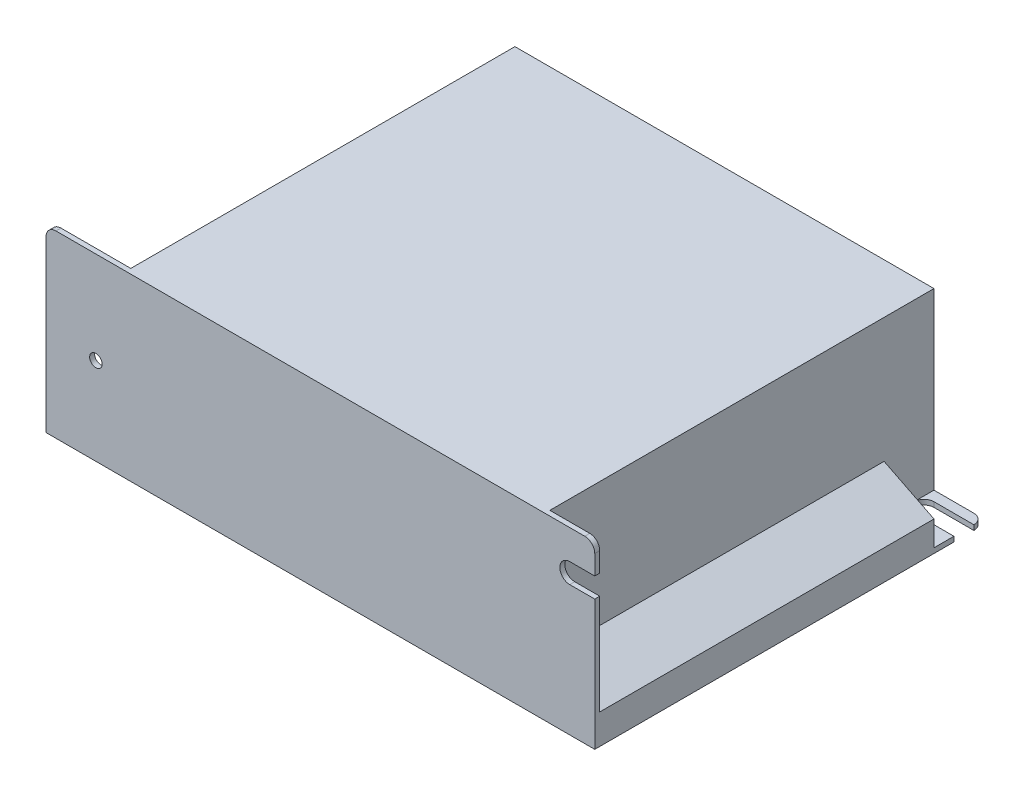
ISO-10303-21;
HEADER;
FILE_DESCRIPTION(('STEP AP214'),'2;1');
FILE_NAME('part.step','',(''),(''),'','','');
FILE_SCHEMA(('AUTOMOTIVE_DESIGN { 1 0 10303 214 1 1 1 1 }'));
ENDSEC;
DATA;
#1=APPLICATION_CONTEXT('core data for automotive mechanical design processes');
#2=APPLICATION_PROTOCOL_DEFINITION('international standard','automotive_design',2000,#1);
#3=PRODUCT_CONTEXT('',#1,'mechanical');
#4=PRODUCT('Part','Part','',(#3));
#5=PRODUCT_RELATED_PRODUCT_CATEGORY('part','',(#4));
#6=PRODUCT_DEFINITION_FORMATION('','',#4);
#7=PRODUCT_DEFINITION_CONTEXT('part definition',#1,'design');
#8=PRODUCT_DEFINITION('design','',#6,#7);
#9=PRODUCT_DEFINITION_SHAPE('','',#8);
#10=(LENGTH_UNIT() NAMED_UNIT(*) SI_UNIT(.MILLI.,.METRE.));
#11=(NAMED_UNIT(*) PLANE_ANGLE_UNIT() SI_UNIT($,.RADIAN.));
#12=(NAMED_UNIT(*) SI_UNIT($,.STERADIAN.) SOLID_ANGLE_UNIT());
#13=UNCERTAINTY_MEASURE_WITH_UNIT(LENGTH_MEASURE(1.E-05),#10,'distance_accuracy_value','');
#14=(GEOMETRIC_REPRESENTATION_CONTEXT(3) GLOBAL_UNCERTAINTY_ASSIGNED_CONTEXT((#13)) GLOBAL_UNIT_ASSIGNED_CONTEXT((#10,
#11,#12)) REPRESENTATION_CONTEXT('',''));
#15=CARTESIAN_POINT('',(0.,0.,0.));
#16=DIRECTION('',(0.,0.,1.));
#17=DIRECTION('',(1.,0.,0.));
#18=AXIS2_PLACEMENT_3D('',#15,#16,#17);
#19=CARTESIAN_POINT('',(0.,0.999999999999994,0.));
#20=DIRECTION('',(0.,-1.,0.));
#21=DIRECTION('',(0.,0.,-1.));
#22=AXIS2_PLACEMENT_3D('',#19,#20,#21);
#23=PLANE('',#22);
#24=DIRECTION('',(0.,0.,-1.));
#25=VECTOR('',#24,1.);
#26=CARTESIAN_POINT('',(110.,0.999999999999994,-78.));
#27=LINE('',#26,#25);
#28=CARTESIAN_POINT('',(110.,0.999999999999994,-68.));
#29=VERTEX_POINT('',#28);
#30=CARTESIAN_POINT('',(110.,0.999999999999994,-72.));
#31=VERTEX_POINT('',#30);
#32=EDGE_CURVE('E271',#29,#31,#27,.T.);
#33=ORIENTED_EDGE('',*,*,#32,.T.);
#34=DIRECTION('',(-1.,0.,0.));
#35=VECTOR('',#34,1.);
#36=CARTESIAN_POINT('',(0.,0.999999999999994,-72.));
#37=LINE('',#36,#35);
#38=CARTESIAN_POINT('',(102.,0.999999999999994,-72.));
#39=VERTEX_POINT('',#38);
#40=EDGE_CURVE('E11',#31,#39,#37,.T.);
#41=ORIENTED_EDGE('',*,*,#40,.T.);
#42=CARTESIAN_POINT('',(102.,0.999999999999994,-74.));
#43=DIRECTION('',(0.,-1.,0.));
#44=DIRECTION('',(0.,0.,-1.));
#45=AXIS2_PLACEMENT_3D('',#42,#43,#44);
#46=CIRCLE('',#45,2.);
#47=CARTESIAN_POINT('',(100.,0.999999999999994,-74.));
#48=VERTEX_POINT('',#47);
#49=EDGE_CURVE('E42',#39,#48,#46,.T.);
#50=ORIENTED_EDGE('',*,*,#49,.T.);
#51=DIRECTION('',(0.,0.,1.));
#52=VECTOR('',#51,1.);
#53=CARTESIAN_POINT('',(100.,0.999999999999994,-78.));
#54=LINE('',#53,#52);
#55=CARTESIAN_POINT('',(100.,0.999999999999994,-68.));
#56=VERTEX_POINT('',#55);
#57=EDGE_CURVE('E276',#48,#56,#54,.T.);
#58=ORIENTED_EDGE('',*,*,#57,.T.);
#59=DIRECTION('',(1.,0.,0.));
#60=VECTOR('',#59,1.);
#61=CARTESIAN_POINT('',(110.,0.999999999999994,-68.));
#62=LINE('',#61,#60);
#63=EDGE_CURVE('E280',#56,#29,#62,.T.);
#64=ORIENTED_EDGE('',*,*,#63,.T.);
#65=EDGE_LOOP('',(#33,#41,#50,#58,#64));
#66=FACE_BOUND('',#65,.T.);
#67=ADVANCED_FACE('F34',(#66),#23,.F.);
#68=CARTESIAN_POINT('',(110.,36.,0.));
#69=DIRECTION('',(-1.,0.,0.));
#70=DIRECTION('',(0.,0.,1.));
#71=AXIS2_PLACEMENT_3D('',#68,#69,#70);
#72=PLANE('',#71);
#73=DIRECTION('',(0.,1.,0.));
#74=VECTOR('',#73,1.);
#75=CARTESIAN_POINT('',(110.,11.,-1.));
#76=LINE('',#75,#74);
#77=CARTESIAN_POINT('',(110.,30.0968957296743,-1.));
#78=VERTEX_POINT('',#77);
#79=CARTESIAN_POINT('',(110.,34.,-1.));
#80=VERTEX_POINT('',#79);
#81=EDGE_CURVE('E303',#78,#80,#76,.T.);
#82=ORIENTED_EDGE('',*,*,#81,.T.);
#83=DIRECTION('',(0.,0.,-1.));
#84=VECTOR('',#83,1.);
#85=CARTESIAN_POINT('',(110.,34.,0.));
#86=LINE('',#85,#84);
#87=CARTESIAN_POINT('',(110.,34.,0.));
#88=VERTEX_POINT('',#87);
#89=EDGE_CURVE('E49',#80,#88,#86,.F.);
#90=ORIENTED_EDGE('',*,*,#89,.T.);
#91=DIRECTION('',(0.,-1.,0.));
#92=VECTOR('',#91,1.);
#93=CARTESIAN_POINT('',(110.,36.,0.));
#94=LINE('',#93,#92);
#95=CARTESIAN_POINT('',(110.,30.0968957296743,0.));
#96=VERTEX_POINT('',#95);
#97=EDGE_CURVE('E370',#88,#96,#94,.T.);
#98=ORIENTED_EDGE('',*,*,#97,.T.);
#99=DIRECTION('',(0.,0.,-1.));
#100=VECTOR('',#99,1.);
#101=CARTESIAN_POINT('',(110.,30.0968957296743,0.));
#102=LINE('',#101,#100);
#103=EDGE_CURVE('E261',#96,#78,#102,.T.);
#104=ORIENTED_EDGE('',*,*,#103,.T.);
#105=EDGE_LOOP('',(#82,#90,#98,#104));
#106=FACE_BOUND('',#105,.T.);
#107=ADVANCED_FACE('F447',(#106),#72,.F.);
#108=CARTESIAN_POINT('',(0.,36.,0.));
#109=DIRECTION('',(1.,0.,0.));
#110=DIRECTION('',(0.,0.,-1.));
#111=AXIS2_PLACEMENT_3D('',#108,#109,#110);
#112=PLANE('',#111);
#113=DIRECTION('',(0.,0.,1.));
#114=VECTOR('',#113,1.);
#115=CARTESIAN_POINT('',(0.,0.999999999999994,-78.));
#116=LINE('',#115,#114);
#117=CARTESIAN_POINT('',(0.,0.999999999999994,-76.));
#118=VERTEX_POINT('',#117);
#119=CARTESIAN_POINT('',(0.,0.999999999999994,-1.));
#120=VERTEX_POINT('',#119);
#121=EDGE_CURVE('E309',#118,#120,#116,.T.);
#122=ORIENTED_EDGE('',*,*,#121,.F.);
#123=DIRECTION('',(0.,-1.,0.));
#124=VECTOR('',#123,1.);
#125=CARTESIAN_POINT('',(0.,36.,-76.));
#126=LINE('',#125,#124);
#127=CARTESIAN_POINT('',(0.,0.,-76.));
#128=VERTEX_POINT('',#127);
#129=EDGE_CURVE('E383',#118,#128,#126,.T.);
#130=ORIENTED_EDGE('',*,*,#129,.T.);
#131=DIRECTION('',(0.,0.,1.));
#132=VECTOR('',#131,1.);
#133=CARTESIAN_POINT('',(0.,0.,0.));
#134=LINE('',#133,#132);
#135=CARTESIAN_POINT('',(0.,0.,0.));
#136=VERTEX_POINT('',#135);
#137=EDGE_CURVE('E352',#128,#136,#134,.T.);
#138=ORIENTED_EDGE('',*,*,#137,.T.);
#139=DIRECTION('',(0.,-1.,0.));
#140=VECTOR('',#139,1.);
#141=CARTESIAN_POINT('',(0.,36.,0.));
#142=LINE('',#141,#140);
#143=CARTESIAN_POINT('',(0.,34.,0.));
#144=VERTEX_POINT('',#143);
#145=EDGE_CURVE('E372',#144,#136,#142,.T.);
#146=ORIENTED_EDGE('',*,*,#145,.F.);
#147=DIRECTION('',(0.,0.,1.));
#148=VECTOR('',#147,1.);
#149=CARTESIAN_POINT('',(0.,34.,0.));
#150=LINE('',#149,#148);
#151=CARTESIAN_POINT('',(0.,34.,-1.));
#152=VERTEX_POINT('',#151);
#153=EDGE_CURVE('E379',#144,#152,#150,.F.);
#154=ORIENTED_EDGE('',*,*,#153,.T.);
#155=DIRECTION('',(0.,1.,0.));
#156=VECTOR('',#155,1.);
#157=CARTESIAN_POINT('',(0.,0.999999999999994,-1.));
#158=LINE('',#157,#156);
#159=EDGE_CURVE('E321',#120,#152,#158,.T.);
#160=ORIENTED_EDGE('',*,*,#159,.F.);
#161=EDGE_LOOP('',(#122,#130,#138,#146,#154,#160));
#162=FACE_BOUND('',#161,.T.);
#163=ADVANCED_FACE('F452',(#162),#112,.F.);
#164=CARTESIAN_POINT('',(0.,36.,0.));
#165=DIRECTION('',(0.,0.,-1.));
#166=DIRECTION('',(-1.,0.,0.));
#167=AXIS2_PLACEMENT_3D('',#164,#165,#166);
#168=PLANE('',#167);
#169=CARTESIAN_POINT('',(10.,17.5,0.));
#170=DIRECTION('',(0.,0.,1.));
#171=DIRECTION('',(1.,0.,0.));
#172=AXIS2_PLACEMENT_3D('',#169,#170,#171);
#173=CIRCLE('',#172,1.25);
#174=CARTESIAN_POINT('',(11.25,17.5,0.));
#175=VERTEX_POINT('',#174);
#176=EDGE_CURVE('E235',#175,#175,#173,.T.);
#177=ORIENTED_EDGE('',*,*,#176,.F.);
#178=EDGE_LOOP('',(#177));
#179=FACE_BOUND('',#178,.T.);
#180=ORIENTED_EDGE('',*,*,#97,.F.);
#181=CARTESIAN_POINT('',(108.,34.,0.));
#182=DIRECTION('',(0.,0.,-1.));
#183=DIRECTION('',(-1.,0.,0.));
#184=AXIS2_PLACEMENT_3D('',#181,#182,#183);
#185=CIRCLE('',#184,2.);
#186=CARTESIAN_POINT('',(108.,36.,0.));
#187=VERTEX_POINT('',#186);
#188=EDGE_CURVE('E410',#88,#187,#185,.F.);
#189=ORIENTED_EDGE('',*,*,#188,.T.);
#190=DIRECTION('',(1.,0.,0.));
#191=VECTOR('',#190,1.);
#192=CARTESIAN_POINT('',(0.,36.,0.));
#193=LINE('',#192,#191);
#194=CARTESIAN_POINT('',(2.,36.,0.));
#195=VERTEX_POINT('',#194);
#196=EDGE_CURVE('E353',#195,#187,#193,.T.);
#197=ORIENTED_EDGE('',*,*,#196,.F.);
#198=CARTESIAN_POINT('',(2.,34.,0.));
#199=DIRECTION('',(0.,0.,-1.));
#200=DIRECTION('',(-1.,0.,0.));
#201=AXIS2_PLACEMENT_3D('',#198,#199,#200);
#202=CIRCLE('',#201,2.);
#203=EDGE_CURVE('E408',#195,#144,#202,.F.);
#204=ORIENTED_EDGE('',*,*,#203,.T.);
#205=ORIENTED_EDGE('',*,*,#145,.T.);
#206=DIRECTION('',(1.,0.,0.));
#207=VECTOR('',#206,1.);
#208=CARTESIAN_POINT('',(0.,0.,0.));
#209=LINE('',#208,#207);
#210=CARTESIAN_POINT('',(110.,0.,0.));
#211=VERTEX_POINT('',#210);
#212=EDGE_CURVE('E362',#136,#211,#209,.T.);
#213=ORIENTED_EDGE('',*,*,#212,.T.);
#214=CARTESIAN_POINT('',(110.,26.0968957296743,0.));
#215=VERTEX_POINT('',#214);
#216=EDGE_CURVE('E359',#215,#211,#94,.T.);
#217=ORIENTED_EDGE('',*,*,#216,.F.);
#218=DIRECTION('',(-1.,0.,0.));
#219=VECTOR('',#218,1.);
#220=CARTESIAN_POINT('',(115.,26.0968957296743,0.));
#221=LINE('',#220,#219);
#222=CARTESIAN_POINT('',(105.,26.0968957296743,0.));
#223=VERTEX_POINT('',#222);
#224=EDGE_CURVE('E239',#215,#223,#221,.T.);
#225=ORIENTED_EDGE('',*,*,#224,.T.);
#226=CARTESIAN_POINT('',(105.,28.0968957296743,0.));
#227=DIRECTION('',(0.,0.,-1.));
#228=DIRECTION('',(-1.,0.,0.));
#229=AXIS2_PLACEMENT_3D('',#226,#227,#228);
#230=CIRCLE('',#229,2.);
#231=CARTESIAN_POINT('',(105.,30.0968957296743,0.));
#232=VERTEX_POINT('',#231);
#233=EDGE_CURVE('E242',#223,#232,#230,.T.);
#234=ORIENTED_EDGE('',*,*,#233,.T.);
#235=DIRECTION('',(1.,0.,0.));
#236=VECTOR('',#235,1.);
#237=CARTESIAN_POINT('',(115.,30.0968957296743,0.));
#238=LINE('',#237,#236);
#239=EDGE_CURVE('E246',#232,#96,#238,.T.);
#240=ORIENTED_EDGE('',*,*,#239,.T.);
#241=EDGE_LOOP('',(#180,#189,#197,#204,#205,#213,#217,#225,#234,#240));
#242=FACE_BOUND('',#241,.T.);
#243=ADVANCED_FACE('F524',(#179,#242),#168,.F.);
#244=DIRECTION('',(0.,0.,-1.));
#245=VECTOR('',#244,1.);
#246=CARTESIAN_POINT('',(110.,0.,0.));
#247=LINE('',#246,#245);
#248=CARTESIAN_POINT('',(110.,0.,-72.));
#249=VERTEX_POINT('',#248);
#250=EDGE_CURVE('E365',#211,#249,#247,.T.);
#251=ORIENTED_EDGE('',*,*,#250,.T.);
#252=DIRECTION('',(0.,1.,0.));
#253=VECTOR('',#252,1.);
#254=CARTESIAN_POINT('',(110.,36.,-72.));
#255=LINE('',#254,#253);
#256=EDGE_CURVE('E232',#249,#31,#255,.T.);
#257=ORIENTED_EDGE('',*,*,#256,.T.);
#258=ORIENTED_EDGE('',*,*,#32,.F.);
#259=DIRECTION('',(0.,1.,0.));
#260=VECTOR('',#259,1.);
#261=CARTESIAN_POINT('',(110.,0.999999999999994,-68.));
#262=LINE('',#261,#260);
#263=CARTESIAN_POINT('',(110.,5.99999999999999,-68.));
#264=VERTEX_POINT('',#263);
#265=EDGE_CURVE('E284',#29,#264,#262,.T.);
#266=ORIENTED_EDGE('',*,*,#265,.T.);
#267=DIRECTION('',(0.,0.,-1.));
#268=VECTOR('',#267,1.);
#269=CARTESIAN_POINT('',(110.,5.99999999999999,-1.));
#270=LINE('',#269,#268);
#271=CARTESIAN_POINT('',(110.,5.99999999999999,-1.));
#272=VERTEX_POINT('',#271);
#273=EDGE_CURVE('E268',#272,#264,#270,.T.);
#274=ORIENTED_EDGE('',*,*,#273,.F.);
#275=CARTESIAN_POINT('',(110.,26.0968957296743,-1.));
#276=VERTEX_POINT('',#275);
#277=EDGE_CURVE('E299',#272,#276,#76,.T.);
#278=ORIENTED_EDGE('',*,*,#277,.T.);
#279=DIRECTION('',(0.,0.,1.));
#280=VECTOR('',#279,1.);
#281=CARTESIAN_POINT('',(110.,26.0968957296743,0.));
#282=LINE('',#281,#280);
#283=EDGE_CURVE('E256',#276,#215,#282,.T.);
#284=ORIENTED_EDGE('',*,*,#283,.T.);
#285=ORIENTED_EDGE('',*,*,#216,.T.);
#286=EDGE_LOOP('',(#251,#257,#258,#266,#274,#278,#284,#285));
#287=FACE_BOUND('',#286,.T.);
#288=ADVANCED_FACE('F454',(#287),#72,.F.);
#289=CARTESIAN_POINT('',(0.,36.,-78.));
#290=DIRECTION('',(0.,0.,1.));
#291=DIRECTION('',(1.,0.,0.));
#292=AXIS2_PLACEMENT_3D('',#289,#290,#291);
#293=PLANE('',#292);
#294=DIRECTION('',(-1.,0.,0.));
#295=VECTOR('',#294,1.);
#296=CARTESIAN_POINT('',(0.,0.,-78.));
#297=LINE('',#296,#295);
#298=CARTESIAN_POINT('',(108.,0.,-78.));
#299=VERTEX_POINT('',#298);
#300=CARTESIAN_POINT('',(2.,0.,-78.));
#301=VERTEX_POINT('',#300);
#302=EDGE_CURVE('E357',#299,#301,#297,.T.);
#303=ORIENTED_EDGE('',*,*,#302,.T.);
#304=DIRECTION('',(0.,-1.,0.));
#305=VECTOR('',#304,1.);
#306=CARTESIAN_POINT('',(2.,36.,-78.));
#307=LINE('',#306,#305);
#308=CARTESIAN_POINT('',(2.,0.999999999999994,-78.));
#309=VERTEX_POINT('',#308);
#310=EDGE_CURVE('E392',#301,#309,#307,.F.);
#311=ORIENTED_EDGE('',*,*,#310,.T.);
#312=DIRECTION('',(-1.,0.,0.));
#313=VECTOR('',#312,1.);
#314=CARTESIAN_POINT('',(0.,0.999999999999994,-78.));
#315=LINE('',#314,#313);
#316=CARTESIAN_POINT('',(16.,0.999999999999994,-78.));
#317=VERTEX_POINT('',#316);
#318=EDGE_CURVE('E318',#317,#309,#315,.T.);
#319=ORIENTED_EDGE('',*,*,#318,.F.);
#320=DIRECTION('',(0.,1.,0.));
#321=VECTOR('',#320,1.);
#322=CARTESIAN_POINT('',(16.,0.999999999999994,-78.));
#323=LINE('',#322,#321);
#324=CARTESIAN_POINT('',(16.,36.,-78.));
#325=VERTEX_POINT('',#324);
#326=EDGE_CURVE('E326',#317,#325,#323,.T.);
#327=ORIENTED_EDGE('',*,*,#326,.T.);
#328=DIRECTION('',(-1.,0.,0.));
#329=VECTOR('',#328,1.);
#330=CARTESIAN_POINT('',(0.,36.,-78.));
#331=LINE('',#330,#329);
#332=CARTESIAN_POINT('',(100.,36.,-78.));
#333=VERTEX_POINT('',#332);
#334=EDGE_CURVE('E356',#333,#325,#331,.T.);
#335=ORIENTED_EDGE('',*,*,#334,.F.);
#336=DIRECTION('',(0.,1.,0.));
#337=VECTOR('',#336,1.);
#338=CARTESIAN_POINT('',(100.,0.999999999999994,-78.));
#339=LINE('',#338,#337);
#340=CARTESIAN_POINT('',(100.,0.999999999999994,-78.));
#341=VERTEX_POINT('',#340);
#342=EDGE_CURVE('E283',#341,#333,#339,.T.);
#343=ORIENTED_EDGE('',*,*,#342,.F.);
#344=DIRECTION('',(-1.,0.,0.));
#345=VECTOR('',#344,1.);
#346=CARTESIAN_POINT('',(110.,0.999999999999994,-78.));
#347=LINE('',#346,#345);
#348=CARTESIAN_POINT('',(108.,0.999999999999994,-78.));
#349=VERTEX_POINT('',#348);
#350=EDGE_CURVE('E274',#349,#341,#347,.T.);
#351=ORIENTED_EDGE('',*,*,#350,.F.);
#352=DIRECTION('',(0.,-1.,0.));
#353=VECTOR('',#352,1.);
#354=CARTESIAN_POINT('',(108.,36.,-78.));
#355=LINE('',#354,#353);
#356=EDGE_CURVE('E389',#349,#299,#355,.T.);
#357=ORIENTED_EDGE('',*,*,#356,.T.);
#358=EDGE_LOOP('',(#303,#311,#319,#327,#335,#343,#351,#357));
#359=FACE_BOUND('',#358,.T.);
#360=ADVANCED_FACE('F430',(#359),#293,.F.);
#361=CARTESIAN_POINT('',(0.,36.,0.));
#362=DIRECTION('',(0.,-1.,0.));
#363=DIRECTION('',(0.,0.,-1.));
#364=AXIS2_PLACEMENT_3D('',#361,#362,#363);
#365=PLANE('',#364);
#366=ORIENTED_EDGE('',*,*,#196,.T.);
#367=DIRECTION('',(0.,0.,-1.));
#368=VECTOR('',#367,1.);
#369=CARTESIAN_POINT('',(108.,36.,0.));
#370=LINE('',#369,#368);
#371=CARTESIAN_POINT('',(108.,36.,-1.));
#372=VERTEX_POINT('',#371);
#373=EDGE_CURVE('E403',#187,#372,#370,.T.);
#374=ORIENTED_EDGE('',*,*,#373,.T.);
#375=DIRECTION('',(1.,0.,0.));
#376=VECTOR('',#375,1.);
#377=CARTESIAN_POINT('',(110.,36.,-1.));
#378=LINE('',#377,#376);
#379=CARTESIAN_POINT('',(100.,36.,-1.));
#380=VERTEX_POINT('',#379);
#381=EDGE_CURVE('E296',#380,#372,#378,.T.);
#382=ORIENTED_EDGE('',*,*,#381,.F.);
#383=DIRECTION('',(0.,0.,1.));
#384=VECTOR('',#383,1.);
#385=CARTESIAN_POINT('',(100.,36.,-68.));
#386=LINE('',#385,#384);
#387=EDGE_CURVE('E287',#333,#380,#386,.T.);
#388=ORIENTED_EDGE('',*,*,#387,.F.);
#389=ORIENTED_EDGE('',*,*,#334,.T.);
#390=DIRECTION('',(0.,0.,-1.));
#391=VECTOR('',#390,1.);
#392=CARTESIAN_POINT('',(16.,36.,-78.));
#393=LINE('',#392,#391);
#394=CARTESIAN_POINT('',(16.,36.,-1.));
#395=VERTEX_POINT('',#394);
#396=EDGE_CURVE('E312',#395,#325,#393,.T.);
#397=ORIENTED_EDGE('',*,*,#396,.F.);
#398=DIRECTION('',(1.,0.,0.));
#399=VECTOR('',#398,1.);
#400=CARTESIAN_POINT('',(0.,36.,-1.));
#401=LINE('',#400,#399);
#402=CARTESIAN_POINT('',(2.,36.,-1.));
#403=VERTEX_POINT('',#402);
#404=EDGE_CURVE('E322',#403,#395,#401,.T.);
#405=ORIENTED_EDGE('',*,*,#404,.F.);
#406=DIRECTION('',(0.,0.,1.));
#407=VECTOR('',#406,1.);
#408=CARTESIAN_POINT('',(2.,36.,0.));
#409=LINE('',#408,#407);
#410=EDGE_CURVE('E400',#403,#195,#409,.T.);
#411=ORIENTED_EDGE('',*,*,#410,.T.);
#412=EDGE_LOOP('',(#366,#374,#382,#388,#389,#397,#405,#411));
#413=FACE_BOUND('',#412,.T.);
#414=ADVANCED_FACE('F515',(#413),#365,.F.);
#415=CARTESIAN_POINT('',(0.,0.,0.));
#416=DIRECTION('',(0.,-1.,0.));
#417=DIRECTION('',(0.,0.,-1.));
#418=AXIS2_PLACEMENT_3D('',#415,#416,#417);
#419=PLANE('',#418);
#420=DIRECTION('',(-1.,0.,0.));
#421=VECTOR('',#420,1.);
#422=CARTESIAN_POINT('',(102.,0.,-72.));
#423=LINE('',#422,#421);
#424=CARTESIAN_POINT('',(102.,0.,-72.));
#425=VERTEX_POINT('',#424);
#426=EDGE_CURVE('E212',#249,#425,#423,.T.);
#427=ORIENTED_EDGE('',*,*,#426,.F.);
#428=ORIENTED_EDGE('',*,*,#250,.F.);
#429=ORIENTED_EDGE('',*,*,#212,.F.);
#430=ORIENTED_EDGE('',*,*,#137,.F.);
#431=CARTESIAN_POINT('',(2.,0.,-76.));
#432=DIRECTION('',(0.,-1.,0.));
#433=DIRECTION('',(0.,0.,-1.));
#434=AXIS2_PLACEMENT_3D('',#431,#432,#433);
#435=CIRCLE('',#434,2.);
#436=EDGE_CURVE('E387',#128,#301,#435,.T.);
#437=ORIENTED_EDGE('',*,*,#436,.T.);
#438=ORIENTED_EDGE('',*,*,#302,.F.);
#439=CARTESIAN_POINT('',(108.,0.,-76.));
#440=DIRECTION('',(0.,-1.,0.));
#441=DIRECTION('',(0.,0.,-1.));
#442=AXIS2_PLACEMENT_3D('',#439,#440,#441);
#443=CIRCLE('',#442,2.);
#444=CARTESIAN_POINT('',(110.,0.,-76.));
#445=VERTEX_POINT('',#444);
#446=EDGE_CURVE('E225',#299,#445,#443,.T.);
#447=ORIENTED_EDGE('',*,*,#446,.T.);
#448=DIRECTION('',(1.,0.,0.));
#449=VECTOR('',#448,1.);
#450=CARTESIAN_POINT('',(102.,0.,-76.));
#451=LINE('',#450,#449);
#452=CARTESIAN_POINT('',(102.,0.,-76.));
#453=VERTEX_POINT('',#452);
#454=EDGE_CURVE('E205',#453,#445,#451,.T.);
#455=ORIENTED_EDGE('',*,*,#454,.F.);
#456=CARTESIAN_POINT('',(102.,0.,-74.));
#457=DIRECTION('',(0.,-1.,0.));
#458=DIRECTION('',(0.,0.,-1.));
#459=AXIS2_PLACEMENT_3D('',#456,#457,#458);
#460=CIRCLE('',#459,2.);
#461=EDGE_CURVE('E215',#425,#453,#460,.T.);
#462=ORIENTED_EDGE('',*,*,#461,.F.);
#463=EDGE_LOOP('',(#427,#428,#429,#430,#437,#438,#447,#455,#462));
#464=FACE_BOUND('',#463,.T.);
#465=CARTESIAN_POINT('',(5.,0.,-4.));
#466=DIRECTION('',(0.,-1.,0.));
#467=DIRECTION('',(0.,0.,-1.));
#468=AXIS2_PLACEMENT_3D('',#465,#466,#467);
#469=CIRCLE('',#468,1.49999999999999);
#470=CARTESIAN_POINT('',(5.,0.,-5.49999999999999));
#471=VERTEX_POINT('',#470);
#472=EDGE_CURVE('E302',#471,#471,#469,.T.);
#473=ORIENTED_EDGE('',*,*,#472,.F.);
#474=EDGE_LOOP('',(#473));
#475=FACE_BOUND('',#474,.T.);
#476=CARTESIAN_POINT('',(67.5,0.,-25.));
#477=DIRECTION('',(0.,-1.,0.));
#478=DIRECTION('',(0.,0.,-1.));
#479=AXIS2_PLACEMENT_3D('',#476,#477,#478);
#480=CIRCLE('',#479,1.24999999999999);
#481=CARTESIAN_POINT('',(67.5,0.,-26.25));
#482=VERTEX_POINT('',#481);
#483=EDGE_CURVE('E329',#482,#482,#480,.T.);
#484=ORIENTED_EDGE('',*,*,#483,.F.);
#485=EDGE_LOOP('',(#484));
#486=FACE_BOUND('',#485,.T.);
#487=CARTESIAN_POINT('',(67.5,0.,-52.5));
#488=DIRECTION('',(0.,-1.,0.));
#489=DIRECTION('',(0.,0.,-1.));
#490=AXIS2_PLACEMENT_3D('',#487,#488,#489);
#491=CIRCLE('',#490,1.24999999999999);
#492=CARTESIAN_POINT('',(67.5,0.,-53.75));
#493=VERTEX_POINT('',#492);
#494=EDGE_CURVE('E340',#493,#493,#491,.T.);
#495=ORIENTED_EDGE('',*,*,#494,.F.);
#496=EDGE_LOOP('',(#495));
#497=FACE_BOUND('',#496,.T.);
#498=CARTESIAN_POINT('',(31.5,0.,-52.5));
#499=DIRECTION('',(0.,-1.,0.));
#500=DIRECTION('',(0.,0.,-1.));
#501=AXIS2_PLACEMENT_3D('',#498,#499,#500);
#502=CIRCLE('',#501,1.24999999999999);
#503=CARTESIAN_POINT('',(31.5,0.,-53.75));
#504=VERTEX_POINT('',#503);
#505=EDGE_CURVE('E346',#504,#504,#502,.T.);
#506=ORIENTED_EDGE('',*,*,#505,.F.);
#507=EDGE_LOOP('',(#506));
#508=FACE_BOUND('',#507,.T.);
#509=ADVANCED_FACE('F222',(#464,#475,#486,#497,#508),#419,.T.);
#510=CARTESIAN_POINT('',(31.5,5.,-52.5));
#511=DIRECTION('',(0.,-1.,0.));
#512=DIRECTION('',(0.,0.,-1.));
#513=AXIS2_PLACEMENT_3D('',#510,#511,#512);
#514=CONICAL_SURFACE('',#513,1.25,1.02974425867666);
#515=CARTESIAN_POINT('',(31.5,5.75107577378445,-52.5));
#516=VERTEX_POINT('',#515);
#517=VERTEX_LOOP('',#516);
#518=FACE_BOUND('',#517,.T.);
#519=CARTESIAN_POINT('',(31.5,5.,-52.5));
#520=DIRECTION('',(0.,-1.,0.));
#521=DIRECTION('',(0.,0.,-1.));
#522=AXIS2_PLACEMENT_3D('',#519,#520,#521);
#523=CIRCLE('',#522,1.25);
#524=CARTESIAN_POINT('',(31.5,5.,-53.75));
#525=VERTEX_POINT('',#524);
#526=EDGE_CURVE('E349',#525,#525,#523,.T.);
#527=ORIENTED_EDGE('',*,*,#526,.T.);
#528=EDGE_LOOP('',(#527));
#529=FACE_BOUND('',#528,.T.);
#530=ADVANCED_FACE('F510',(#518,#529),#514,.F.);
#531=CARTESIAN_POINT('',(31.5,0.,-52.5));
#532=DIRECTION('',(0.,-1.,0.));
#533=DIRECTION('',(0.,0.,-1.));
#534=AXIS2_PLACEMENT_3D('',#531,#532,#533);
#535=CYLINDRICAL_SURFACE('',#534,1.24999999999999);
#536=ORIENTED_EDGE('',*,*,#526,.F.);
#537=EDGE_LOOP('',(#536));
#538=FACE_BOUND('',#537,.T.);
#539=ORIENTED_EDGE('',*,*,#505,.T.);
#540=EDGE_LOOP('',(#539));
#541=FACE_BOUND('',#540,.T.);
#542=ADVANCED_FACE('F506',(#538,#541),#535,.F.);
#543=CARTESIAN_POINT('',(67.5,5.,-52.5));
#544=DIRECTION('',(0.,-1.,0.));
#545=DIRECTION('',(0.,0.,-1.));
#546=AXIS2_PLACEMENT_3D('',#543,#544,#545);
#547=CONICAL_SURFACE('',#546,1.25,1.02974425867666);
#548=CARTESIAN_POINT('',(67.5,5.75107577378445,-52.5));
#549=VERTEX_POINT('',#548);
#550=VERTEX_LOOP('',#549);
#551=FACE_BOUND('',#550,.T.);
#552=CARTESIAN_POINT('',(67.5,5.,-52.5));
#553=DIRECTION('',(0.,-1.,0.));
#554=DIRECTION('',(0.,0.,-1.));
#555=AXIS2_PLACEMENT_3D('',#552,#553,#554);
#556=CIRCLE('',#555,1.25);
#557=CARTESIAN_POINT('',(67.5,5.,-53.75));
#558=VERTEX_POINT('',#557);
#559=EDGE_CURVE('E343',#558,#558,#556,.T.);
#560=ORIENTED_EDGE('',*,*,#559,.T.);
#561=EDGE_LOOP('',(#560));
#562=FACE_BOUND('',#561,.T.);
#563=ADVANCED_FACE('F502',(#551,#562),#547,.F.);
#564=CARTESIAN_POINT('',(67.5,0.,-52.5));
#565=DIRECTION('',(0.,-1.,0.));
#566=DIRECTION('',(0.,0.,-1.));
#567=AXIS2_PLACEMENT_3D('',#564,#565,#566);
#568=CYLINDRICAL_SURFACE('',#567,1.24999999999999);
#569=ORIENTED_EDGE('',*,*,#559,.F.);
#570=EDGE_LOOP('',(#569));
#571=FACE_BOUND('',#570,.T.);
#572=ORIENTED_EDGE('',*,*,#494,.T.);
#573=EDGE_LOOP('',(#572));
#574=FACE_BOUND('',#573,.T.);
#575=ADVANCED_FACE('F498',(#571,#574),#568,.F.);
#576=CARTESIAN_POINT('',(67.5,5.,-25.));
#577=DIRECTION('',(0.,-1.,0.));
#578=DIRECTION('',(0.,0.,-1.));
#579=AXIS2_PLACEMENT_3D('',#576,#577,#578);
#580=CONICAL_SURFACE('',#579,1.25,1.02974425867666);
#581=CARTESIAN_POINT('',(67.5,5.75107577378445,-25.));
#582=VERTEX_POINT('',#581);
#583=VERTEX_LOOP('',#582);
#584=FACE_BOUND('',#583,.T.);
#585=CARTESIAN_POINT('',(67.5,5.,-25.));
#586=DIRECTION('',(0.,-1.,0.));
#587=DIRECTION('',(0.,0.,-1.));
#588=AXIS2_PLACEMENT_3D('',#585,#586,#587);
#589=CIRCLE('',#588,1.25);
#590=CARTESIAN_POINT('',(67.5,5.,-26.25));
#591=VERTEX_POINT('',#590);
#592=EDGE_CURVE('E337',#591,#591,#589,.T.);
#593=ORIENTED_EDGE('',*,*,#592,.T.);
#594=EDGE_LOOP('',(#593));
#595=FACE_BOUND('',#594,.T.);
#596=ADVANCED_FACE('F494',(#584,#595),#580,.F.);
#597=CARTESIAN_POINT('',(67.5,0.,-25.));
#598=DIRECTION('',(0.,-1.,0.));
#599=DIRECTION('',(0.,0.,-1.));
#600=AXIS2_PLACEMENT_3D('',#597,#598,#599);
#601=CYLINDRICAL_SURFACE('',#600,1.24999999999999);
#602=ORIENTED_EDGE('',*,*,#592,.F.);
#603=EDGE_LOOP('',(#602));
#604=FACE_BOUND('',#603,.T.);
#605=ORIENTED_EDGE('',*,*,#483,.T.);
#606=EDGE_LOOP('',(#605));
#607=FACE_BOUND('',#606,.T.);
#608=ADVANCED_FACE('F487',(#604,#607),#601,.F.);
#609=CARTESIAN_POINT('',(16.,0.999999999999994,-78.));
#610=DIRECTION('',(1.,0.,0.));
#611=DIRECTION('',(0.,0.,-1.));
#612=AXIS2_PLACEMENT_3D('',#609,#610,#611);
#613=PLANE('',#612);
#614=ORIENTED_EDGE('',*,*,#396,.T.);
#615=ORIENTED_EDGE('',*,*,#326,.F.);
#616=DIRECTION('',(0.,0.,-1.));
#617=VECTOR('',#616,1.);
#618=CARTESIAN_POINT('',(16.,0.999999999999994,-78.));
#619=LINE('',#618,#617);
#620=CARTESIAN_POINT('',(16.,0.999999999999994,-1.));
#621=VERTEX_POINT('',#620);
#622=EDGE_CURVE('E315',#621,#317,#619,.T.);
#623=ORIENTED_EDGE('',*,*,#622,.F.);
#624=DIRECTION('',(0.,1.,0.));
#625=VECTOR('',#624,1.);
#626=CARTESIAN_POINT('',(16.,0.999999999999994,-1.));
#627=LINE('',#626,#625);
#628=EDGE_CURVE('E330',#621,#395,#627,.T.);
#629=ORIENTED_EDGE('',*,*,#628,.T.);
#630=EDGE_LOOP('',(#614,#615,#623,#629));
#631=FACE_BOUND('',#630,.T.);
#632=ADVANCED_FACE('F484',(#631),#613,.F.);
#633=CARTESIAN_POINT('',(0.,0.999999999999994,-1.));
#634=DIRECTION('',(0.,0.,1.));
#635=DIRECTION('',(1.,0.,0.));
#636=AXIS2_PLACEMENT_3D('',#633,#634,#635);
#637=PLANE('',#636);
#638=CARTESIAN_POINT('',(10.,17.5,-1.));
#639=DIRECTION('',(0.,0.,1.));
#640=DIRECTION('',(1.,0.,0.));
#641=AXIS2_PLACEMENT_3D('',#638,#639,#640);
#642=CIRCLE('',#641,1.24999999999999);
#643=CARTESIAN_POINT('',(11.25,17.5,-1.));
#644=VERTEX_POINT('',#643);
#645=EDGE_CURVE('E238',#644,#644,#642,.T.);
#646=ORIENTED_EDGE('',*,*,#645,.T.);
#647=EDGE_LOOP('',(#646));
#648=FACE_BOUND('',#647,.T.);
#649=ORIENTED_EDGE('',*,*,#159,.T.);
#650=CARTESIAN_POINT('',(2.,34.,-1.));
#651=DIRECTION('',(0.,0.,1.));
#652=DIRECTION('',(1.,0.,0.));
#653=AXIS2_PLACEMENT_3D('',#650,#651,#652);
#654=CIRCLE('',#653,2.);
#655=EDGE_CURVE('E412',#152,#403,#654,.F.);
#656=ORIENTED_EDGE('',*,*,#655,.T.);
#657=ORIENTED_EDGE('',*,*,#404,.T.);
#658=ORIENTED_EDGE('',*,*,#628,.F.);
#659=DIRECTION('',(1.,0.,0.));
#660=VECTOR('',#659,1.);
#661=CARTESIAN_POINT('',(0.,0.999999999999994,-1.));
#662=LINE('',#661,#660);
#663=EDGE_CURVE('E311',#120,#621,#662,.T.);
#664=ORIENTED_EDGE('',*,*,#663,.F.);
#665=EDGE_LOOP('',(#649,#656,#657,#658,#664));
#666=FACE_BOUND('',#665,.T.);
#667=ADVANCED_FACE('F482',(#648,#666),#637,.F.);
#668=CARTESIAN_POINT('',(0.,0.999999999999994,0.));
#669=DIRECTION('',(0.,1.,0.));
#670=DIRECTION('',(0.,0.,1.));
#671=AXIS2_PLACEMENT_3D('',#668,#669,#670);
#672=PLANE('',#671);
#673=CARTESIAN_POINT('',(5.,0.999999999999994,-4.));
#674=DIRECTION('',(0.,1.,0.));
#675=DIRECTION('',(0.,0.,1.));
#676=AXIS2_PLACEMENT_3D('',#673,#674,#675);
#677=CIRCLE('',#676,1.49999999999999);
#678=CARTESIAN_POINT('',(5.,0.999999999999994,-2.50000000000001));
#679=VERTEX_POINT('',#678);
#680=EDGE_CURVE('E308',#679,#679,#677,.T.);
#681=ORIENTED_EDGE('',*,*,#680,.F.);
#682=EDGE_LOOP('',(#681));
#683=FACE_BOUND('',#682,.T.);
#684=ORIENTED_EDGE('',*,*,#318,.T.);
#685=CARTESIAN_POINT('',(2.,0.999999999999994,-76.));
#686=DIRECTION('',(0.,1.,0.));
#687=DIRECTION('',(0.,0.,1.));
#688=AXIS2_PLACEMENT_3D('',#685,#686,#687);
#689=CIRCLE('',#688,2.);
#690=EDGE_CURVE('E394',#309,#118,#689,.T.);
#691=ORIENTED_EDGE('',*,*,#690,.T.);
#692=ORIENTED_EDGE('',*,*,#121,.T.);
#693=ORIENTED_EDGE('',*,*,#663,.T.);
#694=ORIENTED_EDGE('',*,*,#622,.T.);
#695=EDGE_LOOP('',(#684,#691,#692,#693,#694));
#696=FACE_BOUND('',#695,.T.);
#697=ADVANCED_FACE('F478',(#683,#696),#672,.T.);
#698=CARTESIAN_POINT('',(5.,0.,-4.));
#699=DIRECTION('',(0.,-1.,0.));
#700=DIRECTION('',(0.,0.,-1.));
#701=AXIS2_PLACEMENT_3D('',#698,#699,#700);
#702=CYLINDRICAL_SURFACE('',#701,1.49999999999999);
#703=ORIENTED_EDGE('',*,*,#680,.T.);
#704=EDGE_LOOP('',(#703));
#705=FACE_BOUND('',#704,.T.);
#706=ORIENTED_EDGE('',*,*,#472,.T.);
#707=EDGE_LOOP('',(#706));
#708=FACE_BOUND('',#707,.T.);
#709=ADVANCED_FACE('F474',(#705,#708),#702,.F.);
#710=CARTESIAN_POINT('',(110.,11.,-1.));
#711=DIRECTION('',(0.,0.,1.));
#712=DIRECTION('',(1.,0.,0.));
#713=AXIS2_PLACEMENT_3D('',#710,#711,#712);
#714=PLANE('',#713);
#715=ORIENTED_EDGE('',*,*,#381,.T.);
#716=CARTESIAN_POINT('',(108.,34.,-1.));
#717=DIRECTION('',(0.,0.,1.));
#718=DIRECTION('',(1.,0.,0.));
#719=AXIS2_PLACEMENT_3D('',#716,#717,#718);
#720=CIRCLE('',#719,2.);
#721=EDGE_CURVE('E57',#372,#80,#720,.F.);
#722=ORIENTED_EDGE('',*,*,#721,.T.);
#723=ORIENTED_EDGE('',*,*,#81,.F.);
#724=DIRECTION('',(1.,0.,0.));
#725=VECTOR('',#724,1.);
#726=CARTESIAN_POINT('',(115.,30.0968957296743,-1.));
#727=LINE('',#726,#725);
#728=CARTESIAN_POINT('',(105.,30.0968957296743,-1.));
#729=VERTEX_POINT('',#728);
#730=EDGE_CURVE('E243',#729,#78,#727,.T.);
#731=ORIENTED_EDGE('',*,*,#730,.F.);
#732=CARTESIAN_POINT('',(105.,28.0968957296743,-1.));
#733=DIRECTION('',(0.,0.,-1.));
#734=DIRECTION('',(-1.,0.,0.));
#735=AXIS2_PLACEMENT_3D('',#732,#733,#734);
#736=CIRCLE('',#735,2.);
#737=CARTESIAN_POINT('',(105.,26.0968957296743,-1.));
#738=VERTEX_POINT('',#737);
#739=EDGE_CURVE('E250',#738,#729,#736,.T.);
#740=ORIENTED_EDGE('',*,*,#739,.F.);
#741=DIRECTION('',(1.,0.,0.));
#742=VECTOR('',#741,1.);
#743=CARTESIAN_POINT('',(110.,26.0968957296743,-1.));
#744=LINE('',#743,#742);
#745=EDGE_CURVE('E374',#738,#276,#744,.T.);
#746=ORIENTED_EDGE('',*,*,#745,.T.);
#747=ORIENTED_EDGE('',*,*,#277,.F.);
#748=DIRECTION('',(-0.894427190999916,0.447213595499959,0.));
#749=VECTOR('',#748,1.);
#750=CARTESIAN_POINT('',(110.,5.99999999999999,-1.));
#751=LINE('',#750,#749);
#752=CARTESIAN_POINT('',(100.,11.,-1.));
#753=VERTEX_POINT('',#752);
#754=EDGE_CURVE('E265',#272,#753,#751,.T.);
#755=ORIENTED_EDGE('',*,*,#754,.T.);
#756=DIRECTION('',(0.,1.,0.));
#757=VECTOR('',#756,1.);
#758=CARTESIAN_POINT('',(100.,11.,-1.));
#759=LINE('',#758,#757);
#760=EDGE_CURVE('E295',#753,#380,#759,.T.);
#761=ORIENTED_EDGE('',*,*,#760,.T.);
#762=EDGE_LOOP('',(#715,#722,#723,#731,#740,#746,#747,#755,#761));
#763=FACE_BOUND('',#762,.T.);
#764=ADVANCED_FACE('F470',(#763),#714,.F.);
#765=CARTESIAN_POINT('',(100.,11.,-68.));
#766=DIRECTION('',(-1.,0.,0.));
#767=DIRECTION('',(0.,0.,1.));
#768=AXIS2_PLACEMENT_3D('',#765,#766,#767);
#769=PLANE('',#768);
#770=ORIENTED_EDGE('',*,*,#387,.T.);
#771=ORIENTED_EDGE('',*,*,#760,.F.);
#772=DIRECTION('',(0.,0.,1.));
#773=VECTOR('',#772,1.);
#774=CARTESIAN_POINT('',(100.,11.,-68.));
#775=LINE('',#774,#773);
#776=CARTESIAN_POINT('',(100.,11.,-68.));
#777=VERTEX_POINT('',#776);
#778=EDGE_CURVE('E293',#777,#753,#775,.T.);
#779=ORIENTED_EDGE('',*,*,#778,.F.);
#780=DIRECTION('',(0.,1.,0.));
#781=VECTOR('',#780,1.);
#782=CARTESIAN_POINT('',(100.,0.999999999999994,-68.));
#783=LINE('',#782,#781);
#784=EDGE_CURVE('E288',#56,#777,#783,.T.);
#785=ORIENTED_EDGE('',*,*,#784,.F.);
#786=ORIENTED_EDGE('',*,*,#57,.F.);
#787=EDGE_CURVE('E277',#341,#48,#54,.T.);
#788=ORIENTED_EDGE('',*,*,#787,.F.);
#789=ORIENTED_EDGE('',*,*,#342,.T.);
#790=EDGE_LOOP('',(#770,#771,#779,#785,#786,#788,#789));
#791=FACE_BOUND('',#790,.T.);
#792=ADVANCED_FACE('F421',(#791),#769,.F.);
#793=CARTESIAN_POINT('',(110.,0.999999999999994,-68.));
#794=DIRECTION('',(0.,0.,1.));
#795=DIRECTION('',(1.,0.,0.));
#796=AXIS2_PLACEMENT_3D('',#793,#794,#795);
#797=PLANE('',#796);
#798=ORIENTED_EDGE('',*,*,#784,.T.);
#799=DIRECTION('',(-0.894427190999916,0.447213595499959,0.));
#800=VECTOR('',#799,1.);
#801=CARTESIAN_POINT('',(110.,5.99999999999999,-68.));
#802=LINE('',#801,#800);
#803=EDGE_CURVE('E264',#264,#777,#802,.T.);
#804=ORIENTED_EDGE('',*,*,#803,.F.);
#805=ORIENTED_EDGE('',*,*,#265,.F.);
#806=ORIENTED_EDGE('',*,*,#63,.F.);
#807=EDGE_LOOP('',(#798,#804,#805,#806));
#808=FACE_BOUND('',#807,.T.);
#809=ADVANCED_FACE('F459',(#808),#797,.F.);
#810=ORIENTED_EDGE('',*,*,#787,.T.);
#811=CARTESIAN_POINT('',(102.,0.999999999999994,-76.));
#812=VERTEX_POINT('',#811);
#813=EDGE_CURVE('E413',#48,#812,#46,.T.);
#814=ORIENTED_EDGE('',*,*,#813,.T.);
#815=DIRECTION('',(1.,0.,0.));
#816=VECTOR('',#815,1.);
#817=CARTESIAN_POINT('',(0.,0.999999999999994,-76.));
#818=LINE('',#817,#816);
#819=CARTESIAN_POINT('',(110.,0.999999999999994,-76.));
#820=VERTEX_POINT('',#819);
#821=EDGE_CURVE('E208',#812,#820,#818,.T.);
#822=ORIENTED_EDGE('',*,*,#821,.T.);
#823=CARTESIAN_POINT('',(108.,0.999999999999994,-76.));
#824=DIRECTION('',(0.,-1.,0.));
#825=DIRECTION('',(0.,0.,-1.));
#826=AXIS2_PLACEMENT_3D('',#823,#824,#825);
#827=CIRCLE('',#826,2.);
#828=EDGE_CURVE('E398',#820,#349,#827,.F.);
#829=ORIENTED_EDGE('',*,*,#828,.T.);
#830=ORIENTED_EDGE('',*,*,#350,.T.);
#831=EDGE_LOOP('',(#810,#814,#822,#829,#830));
#832=FACE_BOUND('',#831,.T.);
#833=ADVANCED_FACE('F425',(#832),#23,.F.);
#834=CARTESIAN_POINT('',(110.,5.99999999999999,-1.));
#835=DIRECTION('',(-0.447213595499959,-0.894427190999916,0.));
#836=DIRECTION('',(0.894427190999916,-0.447213595499959,0.));
#837=AXIS2_PLACEMENT_3D('',#834,#835,#836);
#838=PLANE('',#837);
#839=ORIENTED_EDGE('',*,*,#803,.T.);
#840=ORIENTED_EDGE('',*,*,#778,.T.);
#841=ORIENTED_EDGE('',*,*,#754,.F.);
#842=ORIENTED_EDGE('',*,*,#273,.T.);
#843=EDGE_LOOP('',(#839,#840,#841,#842));
#844=FACE_BOUND('',#843,.T.);
#845=ADVANCED_FACE('F458',(#844),#838,.F.);
#846=CARTESIAN_POINT('',(115.,30.0968957296743,0.));
#847=DIRECTION('',(0.,1.,0.));
#848=DIRECTION('',(0.,0.,1.));
#849=AXIS2_PLACEMENT_3D('',#846,#847,#848);
#850=PLANE('',#849);
#851=ORIENTED_EDGE('',*,*,#239,.F.);
#852=DIRECTION('',(0.,0.,-1.));
#853=VECTOR('',#852,1.);
#854=CARTESIAN_POINT('',(105.,30.0968957296743,0.));
#855=LINE('',#854,#853);
#856=EDGE_CURVE('E254',#232,#729,#855,.T.);
#857=ORIENTED_EDGE('',*,*,#856,.T.);
#858=ORIENTED_EDGE('',*,*,#730,.T.);
#859=ORIENTED_EDGE('',*,*,#103,.F.);
#860=EDGE_LOOP('',(#851,#857,#858,#859));
#861=FACE_BOUND('',#860,.T.);
#862=ADVANCED_FACE('F464',(#861),#850,.F.);
#863=CARTESIAN_POINT('',(115.,26.0968957296743,0.));
#864=DIRECTION('',(0.,-1.,0.));
#865=DIRECTION('',(0.,0.,-1.));
#866=AXIS2_PLACEMENT_3D('',#863,#864,#865);
#867=PLANE('',#866);
#868=ORIENTED_EDGE('',*,*,#745,.F.);
#869=DIRECTION('',(0.,0.,-1.));
#870=VECTOR('',#869,1.);
#871=CARTESIAN_POINT('',(105.,26.0968957296743,0.));
#872=LINE('',#871,#870);
#873=EDGE_CURVE('E249',#223,#738,#872,.T.);
#874=ORIENTED_EDGE('',*,*,#873,.F.);
#875=ORIENTED_EDGE('',*,*,#224,.F.);
#876=ORIENTED_EDGE('',*,*,#283,.F.);
#877=EDGE_LOOP('',(#868,#874,#875,#876));
#878=FACE_BOUND('',#877,.T.);
#879=ADVANCED_FACE('F575',(#878),#867,.F.);
#880=CARTESIAN_POINT('',(105.,28.0968957296743,0.));
#881=DIRECTION('',(0.,0.,-1.));
#882=DIRECTION('',(-1.,0.,0.));
#883=AXIS2_PLACEMENT_3D('',#880,#881,#882);
#884=CYLINDRICAL_SURFACE('',#883,2.);
#885=ORIENTED_EDGE('',*,*,#739,.T.);
#886=ORIENTED_EDGE('',*,*,#856,.F.);
#887=ORIENTED_EDGE('',*,*,#233,.F.);
#888=ORIENTED_EDGE('',*,*,#873,.T.);
#889=EDGE_LOOP('',(#885,#886,#887,#888));
#890=FACE_BOUND('',#889,.T.);
#891=ADVANCED_FACE('F572',(#890),#884,.F.);
#892=CARTESIAN_POINT('',(10.,17.5,0.));
#893=DIRECTION('',(0.,0.,1.));
#894=DIRECTION('',(1.,0.,0.));
#895=AXIS2_PLACEMENT_3D('',#892,#893,#894);
#896=CYLINDRICAL_SURFACE('',#895,1.24999999999999);
#897=ORIENTED_EDGE('',*,*,#176,.T.);
#898=EDGE_LOOP('',(#897));
#899=FACE_BOUND('',#898,.T.);
#900=ORIENTED_EDGE('',*,*,#645,.F.);
#901=EDGE_LOOP('',(#900));
#902=FACE_BOUND('',#901,.T.);
#903=ADVANCED_FACE('F443',(#899,#902),#896,.F.);
#904=CARTESIAN_POINT('',(2.,36.,-76.));
#905=DIRECTION('',(0.,-1.,0.));
#906=DIRECTION('',(0.,0.,-1.));
#907=AXIS2_PLACEMENT_3D('',#904,#905,#906);
#908=CYLINDRICAL_SURFACE('',#907,2.);
#909=ORIENTED_EDGE('',*,*,#690,.F.);
#910=ORIENTED_EDGE('',*,*,#310,.F.);
#911=ORIENTED_EDGE('',*,*,#436,.F.);
#912=ORIENTED_EDGE('',*,*,#129,.F.);
#913=EDGE_LOOP('',(#909,#910,#911,#912));
#914=FACE_BOUND('',#913,.T.);
#915=ADVANCED_FACE('F436',(#914),#908,.T.);
#916=CARTESIAN_POINT('',(108.,36.,-76.));
#917=DIRECTION('',(0.,-1.,0.));
#918=DIRECTION('',(0.,0.,-1.));
#919=AXIS2_PLACEMENT_3D('',#916,#917,#918);
#920=CYLINDRICAL_SURFACE('',#919,2.);
#921=ORIENTED_EDGE('',*,*,#828,.F.);
#922=DIRECTION('',(0.,-1.,0.));
#923=VECTOR('',#922,1.);
#924=CARTESIAN_POINT('',(110.,36.,-76.));
#925=LINE('',#924,#923);
#926=EDGE_CURVE('E396',#445,#820,#925,.F.);
#927=ORIENTED_EDGE('',*,*,#926,.F.);
#928=ORIENTED_EDGE('',*,*,#446,.F.);
#929=ORIENTED_EDGE('',*,*,#356,.F.);
#930=EDGE_LOOP('',(#921,#927,#928,#929));
#931=FACE_BOUND('',#930,.T.);
#932=ADVANCED_FACE('F433',(#931),#920,.T.);
#933=CARTESIAN_POINT('',(108.,34.,0.));
#934=DIRECTION('',(0.,0.,-1.));
#935=DIRECTION('',(-1.,0.,0.));
#936=AXIS2_PLACEMENT_3D('',#933,#934,#935);
#937=CYLINDRICAL_SURFACE('',#936,2.);
#938=ORIENTED_EDGE('',*,*,#188,.F.);
#939=ORIENTED_EDGE('',*,*,#89,.F.);
#940=ORIENTED_EDGE('',*,*,#721,.F.);
#941=ORIENTED_EDGE('',*,*,#373,.F.);
#942=EDGE_LOOP('',(#938,#939,#940,#941));
#943=FACE_BOUND('',#942,.T.);
#944=ADVANCED_FACE('F435',(#943),#937,.T.);
#945=CARTESIAN_POINT('',(2.,34.,0.));
#946=DIRECTION('',(0.,0.,1.));
#947=DIRECTION('',(1.,0.,0.));
#948=AXIS2_PLACEMENT_3D('',#945,#946,#947);
#949=CYLINDRICAL_SURFACE('',#948,2.);
#950=ORIENTED_EDGE('',*,*,#655,.F.);
#951=ORIENTED_EDGE('',*,*,#153,.F.);
#952=ORIENTED_EDGE('',*,*,#203,.F.);
#953=ORIENTED_EDGE('',*,*,#410,.F.);
#954=EDGE_LOOP('',(#950,#951,#952,#953));
#955=FACE_BOUND('',#954,.T.);
#956=ADVANCED_FACE('F36',(#955),#949,.T.);
#957=CARTESIAN_POINT('',(102.,36.,-74.));
#958=DIRECTION('',(0.,-1.,0.));
#959=DIRECTION('',(0.,0.,-1.));
#960=AXIS2_PLACEMENT_3D('',#957,#958,#959);
#961=CYLINDRICAL_SURFACE('',#960,2.);
#962=DIRECTION('',(0.,-1.,0.));
#963=VECTOR('',#962,1.);
#964=CARTESIAN_POINT('',(102.,36.,-72.));
#965=LINE('',#964,#963);
#966=EDGE_CURVE('E211',#39,#425,#965,.T.);
#967=ORIENTED_EDGE('',*,*,#966,.T.);
#968=ORIENTED_EDGE('',*,*,#461,.T.);
#969=DIRECTION('',(0.,-1.,0.));
#970=VECTOR('',#969,1.);
#971=CARTESIAN_POINT('',(102.,36.,-76.));
#972=LINE('',#971,#970);
#973=EDGE_CURVE('E201',#812,#453,#972,.T.);
#974=ORIENTED_EDGE('',*,*,#973,.F.);
#975=ORIENTED_EDGE('',*,*,#813,.F.);
#976=ORIENTED_EDGE('',*,*,#49,.F.);
#977=EDGE_LOOP('',(#967,#968,#974,#975,#976));
#978=FACE_BOUND('',#977,.T.);
#979=ADVANCED_FACE('F216',(#978),#961,.F.);
#980=CARTESIAN_POINT('',(102.,36.,-72.));
#981=DIRECTION('',(0.,0.,1.));
#982=DIRECTION('',(1.,0.,0.));
#983=AXIS2_PLACEMENT_3D('',#980,#981,#982);
#984=PLANE('',#983);
#985=ORIENTED_EDGE('',*,*,#426,.T.);
#986=ORIENTED_EDGE('',*,*,#966,.F.);
#987=ORIENTED_EDGE('',*,*,#40,.F.);
#988=ORIENTED_EDGE('',*,*,#256,.F.);
#989=EDGE_LOOP('',(#985,#986,#987,#988));
#990=FACE_BOUND('',#989,.T.);
#991=ADVANCED_FACE('F554',(#990),#984,.F.);
#992=CARTESIAN_POINT('',(102.,36.,-76.));
#993=DIRECTION('',(0.,0.,-1.));
#994=DIRECTION('',(-1.,0.,0.));
#995=AXIS2_PLACEMENT_3D('',#992,#993,#994);
#996=PLANE('',#995);
#997=ORIENTED_EDGE('',*,*,#973,.T.);
#998=ORIENTED_EDGE('',*,*,#454,.T.);
#999=ORIENTED_EDGE('',*,*,#926,.T.);
#1000=ORIENTED_EDGE('',*,*,#821,.F.);
#1001=EDGE_LOOP('',(#997,#998,#999,#1000));
#1002=FACE_BOUND('',#1001,.T.);
#1003=ADVANCED_FACE('F203',(#1002),#996,.F.);
#1004=CLOSED_SHELL('',(#67,#107,#163,#243,#288,#360,#414,#509,#530,#542,#563,#575,#596,#608,
#632,#667,#697,#709,#764,#792,#809,#833,#845,#862,#879,#891,#903,#915,#932,#944,#956,#979,#991,#1003));
#1005=MANIFOLD_SOLID_BREP('B2',#1004);
#1006=ADVANCED_BREP_SHAPE_REPRESENTATION('',(#18,#1005),#14);
#1007=SHAPE_DEFINITION_REPRESENTATION(#9,#1006);
ENDSEC;
END-ISO-10303-21;
